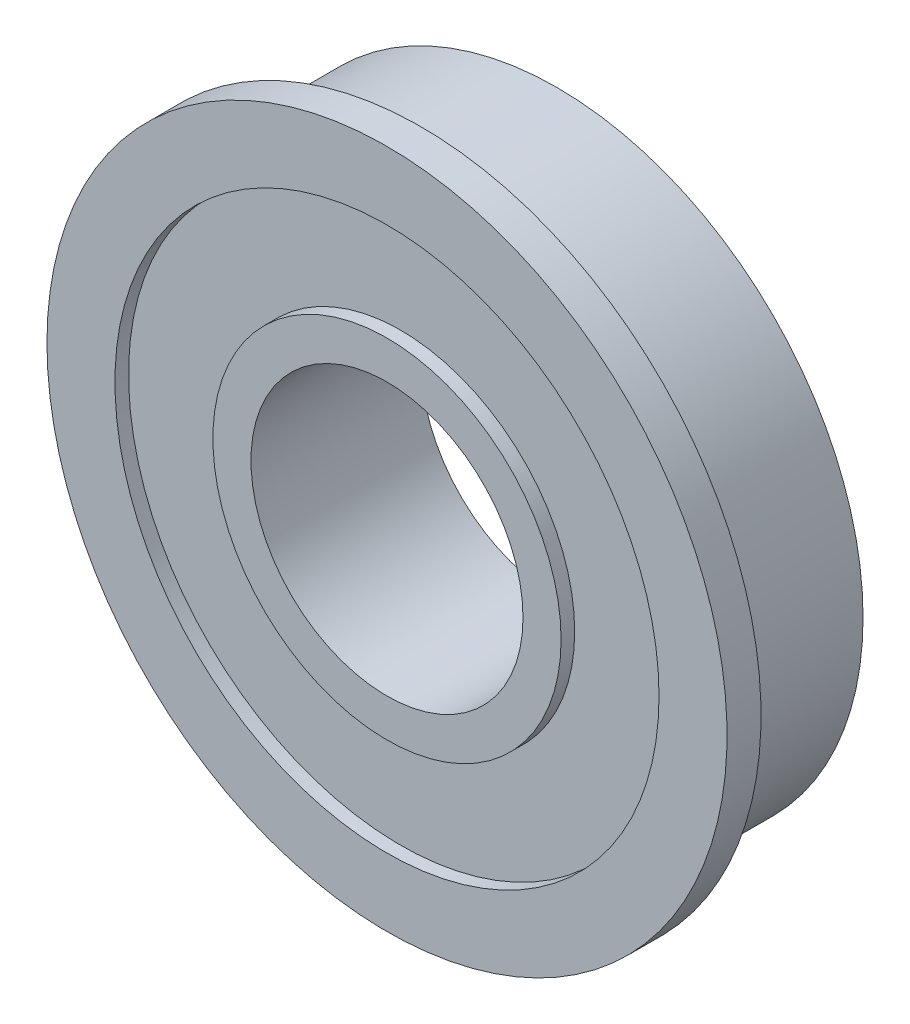
ISO-10303-21;
HEADER;
FILE_DESCRIPTION(('STEP AP214'),'2;1');
FILE_NAME('part.step','',(''),(''),'','','');
FILE_SCHEMA(('AUTOMOTIVE_DESIGN { 1 0 10303 214 1 1 1 1 }'));
ENDSEC;
DATA;
#1=APPLICATION_CONTEXT('core data for automotive mechanical design processes');
#2=APPLICATION_PROTOCOL_DEFINITION('international standard','automotive_design',2000,#1);
#3=PRODUCT_CONTEXT('',#1,'mechanical');
#4=PRODUCT('Part','Part','',(#3));
#5=PRODUCT_RELATED_PRODUCT_CATEGORY('part','',(#4));
#6=PRODUCT_DEFINITION_FORMATION('','',#4);
#7=PRODUCT_DEFINITION_CONTEXT('part definition',#1,'design');
#8=PRODUCT_DEFINITION('design','',#6,#7);
#9=PRODUCT_DEFINITION_SHAPE('','',#8);
#10=(LENGTH_UNIT() NAMED_UNIT(*) SI_UNIT(.MILLI.,.METRE.));
#11=(NAMED_UNIT(*) PLANE_ANGLE_UNIT() SI_UNIT($,.RADIAN.));
#12=(NAMED_UNIT(*) SI_UNIT($,.STERADIAN.) SOLID_ANGLE_UNIT());
#13=UNCERTAINTY_MEASURE_WITH_UNIT(LENGTH_MEASURE(1.E-05),#10,'distance_accuracy_value','');
#14=(GEOMETRIC_REPRESENTATION_CONTEXT(3) GLOBAL_UNCERTAINTY_ASSIGNED_CONTEXT((#13)) GLOBAL_UNIT_ASSIGNED_CONTEXT((#10,
#11,#12)) REPRESENTATION_CONTEXT('',''));
#15=CARTESIAN_POINT('',(0.,0.,0.));
#16=DIRECTION('',(0.,0.,1.));
#17=DIRECTION('',(1.,0.,0.));
#18=AXIS2_PLACEMENT_3D('',#15,#16,#17);
#19=CARTESIAN_POINT('',(0.,0.,0.));
#20=DIRECTION('',(0.,0.,1.));
#21=DIRECTION('',(1.,0.,0.));
#22=AXIS2_PLACEMENT_3D('',#19,#20,#21);
#23=CYLINDRICAL_SURFACE('',#22,12.7);
#24=CARTESIAN_POINT('',(0.,0.,3.33375));
#25=DIRECTION('',(0.,0.,1.));
#26=DIRECTION('',(1.,0.,0.));
#27=AXIS2_PLACEMENT_3D('',#24,#25,#26);
#28=CIRCLE('',#27,12.7);
#29=CARTESIAN_POINT('',(12.7,0.,3.33375));
#30=VERTEX_POINT('',#29);
#31=EDGE_CURVE('E57',#30,#30,#28,.T.);
#32=ORIENTED_EDGE('',*,*,#31,.F.);
#33=EDGE_LOOP('',(#32));
#34=FACE_BOUND('',#33,.T.);
#35=CARTESIAN_POINT('',(0.,0.,3.96875));
#36=DIRECTION('',(0.,0.,1.));
#37=DIRECTION('',(1.,0.,0.));
#38=AXIS2_PLACEMENT_3D('',#35,#36,#37);
#39=CIRCLE('',#38,12.7);
#40=CARTESIAN_POINT('',(12.7,0.,3.96875));
#41=VERTEX_POINT('',#40);
#42=EDGE_CURVE('E17',#41,#41,#39,.F.);
#43=ORIENTED_EDGE('',*,*,#42,.F.);
#44=EDGE_LOOP('',(#43));
#45=FACE_BOUND('',#44,.T.);
#46=ADVANCED_FACE('F14',(#34,#45),#23,.F.);
#47=CARTESIAN_POINT('',(1.29886363636365,0.,3.96875));
#48=DIRECTION('',(0.,0.,1.));
#49=DIRECTION('',(1.,0.,0.));
#50=AXIS2_PLACEMENT_3D('',#47,#48,#49);
#51=PLANE('',#50);
#52=ORIENTED_EDGE('',*,*,#42,.T.);
#53=EDGE_LOOP('',(#52));
#54=FACE_BOUND('',#53,.T.);
#55=CARTESIAN_POINT('',(0.,0.,3.96875));
#56=DIRECTION('',(0.,0.,-1.));
#57=DIRECTION('',(-1.,0.,0.));
#58=AXIS2_PLACEMENT_3D('',#55,#56,#57);
#59=CIRCLE('',#58,15.875);
#60=CARTESIAN_POINT('',(-15.875,0.,3.96875));
#61=VERTEX_POINT('',#60);
#62=EDGE_CURVE('E55',#61,#61,#59,.T.);
#63=ORIENTED_EDGE('',*,*,#62,.F.);
#64=EDGE_LOOP('',(#63));
#65=FACE_BOUND('',#64,.T.);
#66=ADVANCED_FACE('F64',(#54,#65),#51,.T.);
#67=CARTESIAN_POINT('',(1.15454545454544,0.,3.33375));
#68=DIRECTION('',(0.,0.,1.));
#69=DIRECTION('',(1.,0.,0.));
#70=AXIS2_PLACEMENT_3D('',#67,#68,#69);
#71=PLANE('',#70);
#72=CARTESIAN_POINT('',(0.,0.,3.33375));
#73=DIRECTION('',(0.,0.,1.));
#74=DIRECTION('',(1.,0.,0.));
#75=AXIS2_PLACEMENT_3D('',#72,#73,#74);
#76=CIRCLE('',#75,8.128);
#77=CARTESIAN_POINT('',(8.128,0.,3.33375));
#78=VERTEX_POINT('',#77);
#79=EDGE_CURVE('E52',#78,#78,#76,.T.);
#80=ORIENTED_EDGE('',*,*,#79,.F.);
#81=EDGE_LOOP('',(#80));
#82=FACE_BOUND('',#81,.T.);
#83=ORIENTED_EDGE('',*,*,#31,.T.);
#84=EDGE_LOOP('',(#83));
#85=FACE_BOUND('',#84,.T.);
#86=ADVANCED_FACE('F73',(#82,#85),#71,.T.);
#87=CARTESIAN_POINT('',(0.,0.,3.96875));
#88=DIRECTION('',(0.,0.,-1.));
#89=DIRECTION('',(-1.,0.,0.));
#90=AXIS2_PLACEMENT_3D('',#87,#88,#89);
#91=CYLINDRICAL_SURFACE('',#90,15.875);
#92=ORIENTED_EDGE('',*,*,#62,.T.);
#93=EDGE_LOOP('',(#92));
#94=FACE_BOUND('',#93,.T.);
#95=CARTESIAN_POINT('',(0.,0.,2.38125));
#96=DIRECTION('',(0.,0.,-1.));
#97=DIRECTION('',(-1.,0.,0.));
#98=AXIS2_PLACEMENT_3D('',#95,#96,#97);
#99=CIRCLE('',#98,15.875);
#100=CARTESIAN_POINT('',(-15.875,0.,2.38125));
#101=VERTEX_POINT('',#100);
#102=EDGE_CURVE('E49',#101,#101,#99,.F.);
#103=ORIENTED_EDGE('',*,*,#102,.T.);
#104=EDGE_LOOP('',(#103));
#105=FACE_BOUND('',#104,.T.);
#106=ADVANCED_FACE('F117',(#94,#105),#91,.T.);
#107=CARTESIAN_POINT('',(0.,0.,0.));
#108=DIRECTION('',(0.,0.,1.));
#109=DIRECTION('',(1.,0.,0.));
#110=AXIS2_PLACEMENT_3D('',#107,#108,#109);
#111=CYLINDRICAL_SURFACE('',#110,8.128);
#112=CARTESIAN_POINT('',(0.,0.,3.96875));
#113=DIRECTION('',(0.,0.,1.));
#114=DIRECTION('',(1.,0.,0.));
#115=AXIS2_PLACEMENT_3D('',#112,#113,#114);
#116=CIRCLE('',#115,8.128);
#117=CARTESIAN_POINT('',(8.128,0.,3.96875));
#118=VERTEX_POINT('',#117);
#119=EDGE_CURVE('E46',#118,#118,#116,.T.);
#120=ORIENTED_EDGE('',*,*,#119,.F.);
#121=EDGE_LOOP('',(#120));
#122=FACE_BOUND('',#121,.T.);
#123=ORIENTED_EDGE('',*,*,#79,.T.);
#124=EDGE_LOOP('',(#123));
#125=FACE_BOUND('',#124,.T.);
#126=ADVANCED_FACE('F113',(#122,#125),#111,.T.);
#127=CARTESIAN_POINT('',(1.44318181818182,0.,2.38125));
#128=DIRECTION('',(0.,0.,1.));
#129=DIRECTION('',(1.,0.,0.));
#130=AXIS2_PLACEMENT_3D('',#127,#128,#129);
#131=PLANE('',#130);
#132=CARTESIAN_POINT('',(0.,0.,2.38125));
#133=DIRECTION('',(0.,0.,1.));
#134=DIRECTION('',(1.,0.,0.));
#135=AXIS2_PLACEMENT_3D('',#132,#133,#134);
#136=CIRCLE('',#135,14.2875);
#137=CARTESIAN_POINT('',(14.2875,0.,2.38125));
#138=VERTEX_POINT('',#137);
#139=EDGE_CURVE('E43',#138,#138,#136,.F.);
#140=ORIENTED_EDGE('',*,*,#139,.F.);
#141=EDGE_LOOP('',(#140));
#142=FACE_BOUND('',#141,.T.);
#143=ORIENTED_EDGE('',*,*,#102,.F.);
#144=EDGE_LOOP('',(#143));
#145=FACE_BOUND('',#144,.T.);
#146=ADVANCED_FACE('F109',(#142,#145),#131,.F.);
#147=CARTESIAN_POINT('',(0.738909090909089,0.,3.96875));
#148=DIRECTION('',(0.,0.,1.));
#149=DIRECTION('',(1.,0.,0.));
#150=AXIS2_PLACEMENT_3D('',#147,#148,#149);
#151=PLANE('',#150);
#152=CARTESIAN_POINT('',(0.,0.,3.96875));
#153=DIRECTION('',(0.,0.,1.));
#154=DIRECTION('',(1.,0.,0.));
#155=AXIS2_PLACEMENT_3D('',#152,#153,#154);
#156=CIRCLE('',#155,6.35);
#157=CARTESIAN_POINT('',(6.35,0.,3.96875));
#158=VERTEX_POINT('',#157);
#159=EDGE_CURVE('E40',#158,#158,#156,.F.);
#160=ORIENTED_EDGE('',*,*,#159,.T.);
#161=EDGE_LOOP('',(#160));
#162=FACE_BOUND('',#161,.T.);
#163=ORIENTED_EDGE('',*,*,#119,.T.);
#164=EDGE_LOOP('',(#163));
#165=FACE_BOUND('',#164,.T.);
#166=ADVANCED_FACE('F105',(#162,#165),#151,.T.);
#167=CARTESIAN_POINT('',(0.,0.,0.));
#168=DIRECTION('',(0.,0.,1.));
#169=DIRECTION('',(1.,0.,0.));
#170=AXIS2_PLACEMENT_3D('',#167,#168,#169);
#171=CYLINDRICAL_SURFACE('',#170,14.2875);
#172=ORIENTED_EDGE('',*,*,#139,.T.);
#173=EDGE_LOOP('',(#172));
#174=FACE_BOUND('',#173,.T.);
#175=CARTESIAN_POINT('',(0.,0.,-3.96875));
#176=DIRECTION('',(0.,0.,1.));
#177=DIRECTION('',(1.,0.,0.));
#178=AXIS2_PLACEMENT_3D('',#175,#176,#177);
#179=CIRCLE('',#178,14.2875);
#180=CARTESIAN_POINT('',(14.2875,0.,-3.96875));
#181=VERTEX_POINT('',#180);
#182=EDGE_CURVE('E37',#181,#181,#179,.T.);
#183=ORIENTED_EDGE('',*,*,#182,.T.);
#184=EDGE_LOOP('',(#183));
#185=FACE_BOUND('',#184,.T.);
#186=ADVANCED_FACE('F101',(#174,#185),#171,.T.);
#187=CARTESIAN_POINT('',(0.,0.,0.));
#188=DIRECTION('',(0.,0.,1.));
#189=DIRECTION('',(1.,0.,0.));
#190=AXIS2_PLACEMENT_3D('',#187,#188,#189);
#191=CYLINDRICAL_SURFACE('',#190,6.35);
#192=CARTESIAN_POINT('',(0.,0.,-3.96875));
#193=DIRECTION('',(0.,0.,1.));
#194=DIRECTION('',(1.,0.,0.));
#195=AXIS2_PLACEMENT_3D('',#192,#193,#194);
#196=CIRCLE('',#195,6.35);
#197=CARTESIAN_POINT('',(6.35,0.,-3.96875));
#198=VERTEX_POINT('',#197);
#199=EDGE_CURVE('E34',#198,#198,#196,.F.);
#200=ORIENTED_EDGE('',*,*,#199,.T.);
#201=EDGE_LOOP('',(#200));
#202=FACE_BOUND('',#201,.T.);
#203=ORIENTED_EDGE('',*,*,#159,.F.);
#204=EDGE_LOOP('',(#203));
#205=FACE_BOUND('',#204,.T.);
#206=ADVANCED_FACE('F97',(#202,#205),#191,.F.);
#207=CARTESIAN_POINT('',(1.29886363636365,0.,-3.96875));
#208=DIRECTION('',(0.,0.,1.));
#209=DIRECTION('',(1.,0.,0.));
#210=AXIS2_PLACEMENT_3D('',#207,#208,#209);
#211=PLANE('',#210);
#212=CARTESIAN_POINT('',(0.,0.,-3.96875));
#213=DIRECTION('',(0.,0.,1.));
#214=DIRECTION('',(1.,0.,0.));
#215=AXIS2_PLACEMENT_3D('',#212,#213,#214);
#216=CIRCLE('',#215,12.7);
#217=CARTESIAN_POINT('',(12.7,0.,-3.96875));
#218=VERTEX_POINT('',#217);
#219=EDGE_CURVE('E31',#218,#218,#216,.T.);
#220=ORIENTED_EDGE('',*,*,#219,.T.);
#221=EDGE_LOOP('',(#220));
#222=FACE_BOUND('',#221,.T.);
#223=ORIENTED_EDGE('',*,*,#182,.F.);
#224=EDGE_LOOP('',(#223));
#225=FACE_BOUND('',#224,.T.);
#226=ADVANCED_FACE('F93',(#222,#225),#211,.F.);
#227=CARTESIAN_POINT('',(0.738909090909089,0.,-3.96875));
#228=DIRECTION('',(0.,0.,1.));
#229=DIRECTION('',(1.,0.,0.));
#230=AXIS2_PLACEMENT_3D('',#227,#228,#229);
#231=PLANE('',#230);
#232=ORIENTED_EDGE('',*,*,#199,.F.);
#233=EDGE_LOOP('',(#232));
#234=FACE_BOUND('',#233,.T.);
#235=CARTESIAN_POINT('',(0.,0.,-3.96875));
#236=DIRECTION('',(0.,0.,1.));
#237=DIRECTION('',(1.,0.,0.));
#238=AXIS2_PLACEMENT_3D('',#235,#236,#237);
#239=CIRCLE('',#238,8.128);
#240=CARTESIAN_POINT('',(8.128,0.,-3.96875));
#241=VERTEX_POINT('',#240);
#242=EDGE_CURVE('E26',#241,#241,#239,.T.);
#243=ORIENTED_EDGE('',*,*,#242,.F.);
#244=EDGE_LOOP('',(#243));
#245=FACE_BOUND('',#244,.T.);
#246=ADVANCED_FACE('F89',(#234,#245),#231,.F.);
#247=CARTESIAN_POINT('',(0.,0.,0.));
#248=DIRECTION('',(0.,0.,1.));
#249=DIRECTION('',(1.,0.,0.));
#250=AXIS2_PLACEMENT_3D('',#247,#248,#249);
#251=CYLINDRICAL_SURFACE('',#250,12.7);
#252=ORIENTED_EDGE('',*,*,#219,.F.);
#253=EDGE_LOOP('',(#252));
#254=FACE_BOUND('',#253,.T.);
#255=CARTESIAN_POINT('',(0.,0.,-3.33375));
#256=DIRECTION('',(0.,0.,1.));
#257=DIRECTION('',(1.,0.,0.));
#258=AXIS2_PLACEMENT_3D('',#255,#256,#257);
#259=CIRCLE('',#258,12.7);
#260=CARTESIAN_POINT('',(12.7,0.,-3.33375));
#261=VERTEX_POINT('',#260);
#262=EDGE_CURVE('E21',#261,#261,#259,.T.);
#263=ORIENTED_EDGE('',*,*,#262,.T.);
#264=EDGE_LOOP('',(#263));
#265=FACE_BOUND('',#264,.T.);
#266=ADVANCED_FACE('F82',(#254,#265),#251,.F.);
#267=CARTESIAN_POINT('',(0.,0.,0.));
#268=DIRECTION('',(0.,0.,1.));
#269=DIRECTION('',(1.,0.,0.));
#270=AXIS2_PLACEMENT_3D('',#267,#268,#269);
#271=CYLINDRICAL_SURFACE('',#270,8.128);
#272=ORIENTED_EDGE('',*,*,#242,.T.);
#273=EDGE_LOOP('',(#272));
#274=FACE_BOUND('',#273,.T.);
#275=CARTESIAN_POINT('',(0.,0.,-3.33375));
#276=DIRECTION('',(0.,0.,1.));
#277=DIRECTION('',(1.,0.,0.));
#278=AXIS2_PLACEMENT_3D('',#275,#276,#277);
#279=CIRCLE('',#278,8.128);
#280=CARTESIAN_POINT('',(8.128,0.,-3.33375));
#281=VERTEX_POINT('',#280);
#282=EDGE_CURVE('E9',#281,#281,#279,.F.);
#283=ORIENTED_EDGE('',*,*,#282,.T.);
#284=EDGE_LOOP('',(#283));
#285=FACE_BOUND('',#284,.T.);
#286=ADVANCED_FACE('F76',(#274,#285),#271,.T.);
#287=CARTESIAN_POINT('',(1.15454545454544,0.,-3.33375));
#288=DIRECTION('',(0.,0.,1.));
#289=DIRECTION('',(1.,0.,0.));
#290=AXIS2_PLACEMENT_3D('',#287,#288,#289);
#291=PLANE('',#290);
#292=ORIENTED_EDGE('',*,*,#282,.F.);
#293=EDGE_LOOP('',(#292));
#294=FACE_BOUND('',#293,.T.);
#295=ORIENTED_EDGE('',*,*,#262,.F.);
#296=EDGE_LOOP('',(#295));
#297=FACE_BOUND('',#296,.T.);
#298=ADVANCED_FACE('F74',(#294,#297),#291,.F.);
#299=CLOSED_SHELL('',(#46,#66,#86,#106,#126,#146,#166,#186,#206,#226,#246,#266,#286,#298));
#300=MANIFOLD_SOLID_BREP('B1',#299);
#301=ADVANCED_BREP_SHAPE_REPRESENTATION('',(#18,#300),#14);
#302=SHAPE_DEFINITION_REPRESENTATION(#9,#301);
ENDSEC;
END-ISO-10303-21;
